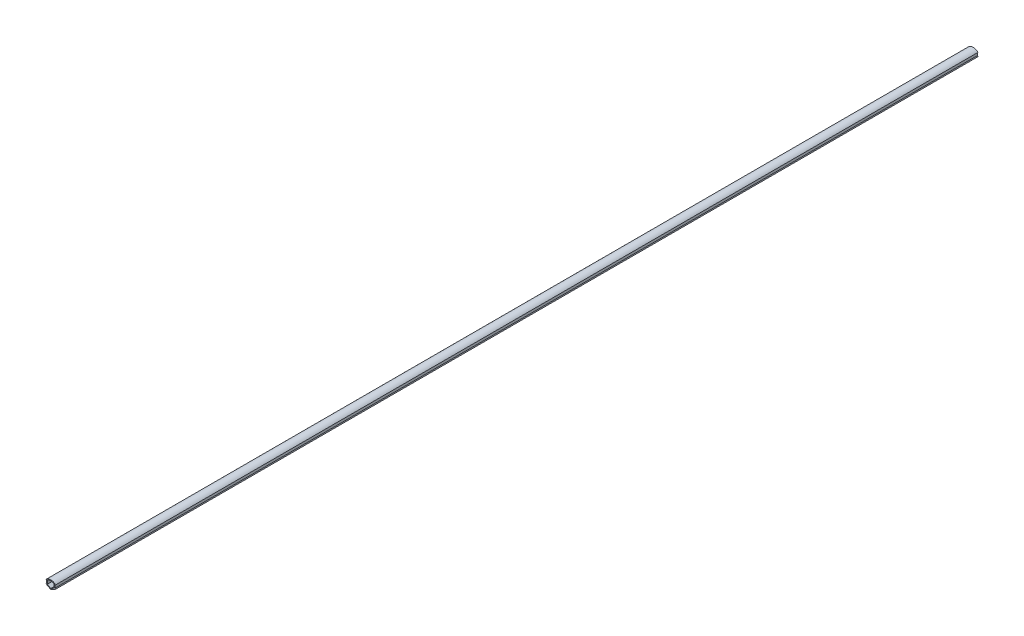
ISO-10303-21;
HEADER;
FILE_DESCRIPTION(('STEP AP214'),'2;1');
FILE_NAME('part.step','',(''),(''),'','','');
FILE_SCHEMA(('AUTOMOTIVE_DESIGN { 1 0 10303 214 1 1 1 1 }'));
ENDSEC;
DATA;
#1=APPLICATION_CONTEXT('core data for automotive mechanical design processes');
#2=APPLICATION_PROTOCOL_DEFINITION('international standard','automotive_design',2000,#1);
#3=PRODUCT_CONTEXT('',#1,'mechanical');
#4=PRODUCT('Part','Part','',(#3));
#5=PRODUCT_RELATED_PRODUCT_CATEGORY('part','',(#4));
#6=PRODUCT_DEFINITION_FORMATION('','',#4);
#7=PRODUCT_DEFINITION_CONTEXT('part definition',#1,'design');
#8=PRODUCT_DEFINITION('design','',#6,#7);
#9=PRODUCT_DEFINITION_SHAPE('','',#8);
#10=(LENGTH_UNIT() NAMED_UNIT(*) SI_UNIT(.MILLI.,.METRE.));
#11=(NAMED_UNIT(*) PLANE_ANGLE_UNIT() SI_UNIT($,.RADIAN.));
#12=(NAMED_UNIT(*) SI_UNIT($,.STERADIAN.) SOLID_ANGLE_UNIT());
#13=UNCERTAINTY_MEASURE_WITH_UNIT(LENGTH_MEASURE(1.E-05),#10,'distance_accuracy_value','');
#14=(GEOMETRIC_REPRESENTATION_CONTEXT(3) GLOBAL_UNCERTAINTY_ASSIGNED_CONTEXT((#13)) GLOBAL_UNIT_ASSIGNED_CONTEXT((#10,
#11,#12)) REPRESENTATION_CONTEXT('',''));
#15=CARTESIAN_POINT('',(0.,0.,0.));
#16=DIRECTION('',(0.,0.,1.));
#17=DIRECTION('',(1.,0.,0.));
#18=AXIS2_PLACEMENT_3D('',#15,#16,#17);
#19=CARTESIAN_POINT('',(0.,0.,1000.));
#20=DIRECTION('',(-0.499999999999998,-0.86602540378444,0.));
#21=DIRECTION('',(0.86602540378444,-0.499999999999998,0.));
#22=AXIS2_PLACEMENT_3D('',#19,#20,#21);
#23=PLANE('',#22);
#24=DIRECTION('',(-0.86602540378444,0.499999999999998,0.));
#25=VECTOR('',#24,1.);
#26=CARTESIAN_POINT('',(0.,0.,0.));
#27=LINE('',#26,#25);
#28=CARTESIAN_POINT('',(0.,0.,0.));
#29=VERTEX_POINT('',#28);
#30=CARTESIAN_POINT('',(-5.2,3.00222139978603,0.));
#31=VERTEX_POINT('',#30);
#32=EDGE_CURVE('E186',#29,#31,#27,.T.);
#33=ORIENTED_EDGE('',*,*,#32,.F.);
#34=DIRECTION('',(0.,0.,-1.));
#35=VECTOR('',#34,1.);
#36=CARTESIAN_POINT('',(0.,0.,1000.));
#37=LINE('',#36,#35);
#38=CARTESIAN_POINT('',(0.,0.,1000.));
#39=VERTEX_POINT('',#38);
#40=EDGE_CURVE('E11',#39,#29,#37,.T.);
#41=ORIENTED_EDGE('',*,*,#40,.F.);
#42=DIRECTION('',(-0.86602540378444,0.499999999999998,0.));
#43=VECTOR('',#42,1.);
#44=CARTESIAN_POINT('',(0.,0.,1000.));
#45=LINE('',#44,#43);
#46=CARTESIAN_POINT('',(-5.2,3.00222139978603,1000.));
#47=VERTEX_POINT('',#46);
#48=EDGE_CURVE('E264',#39,#47,#45,.T.);
#49=ORIENTED_EDGE('',*,*,#48,.T.);
#50=DIRECTION('',(0.,0.,-1.));
#51=VECTOR('',#50,1.);
#52=CARTESIAN_POINT('',(-5.2,3.00222139978603,1000.));
#53=LINE('',#52,#51);
#54=EDGE_CURVE('E56',#47,#31,#53,.T.);
#55=ORIENTED_EDGE('',*,*,#54,.T.);
#56=EDGE_LOOP('',(#33,#41,#49,#55));
#57=FACE_BOUND('',#56,.T.);
#58=ADVANCED_FACE('F37',(#57),#23,.T.);
#59=CARTESIAN_POINT('',(0.,0.,1000.));
#60=DIRECTION('',(-0.499999999999998,0.86602540378444,0.));
#61=DIRECTION('',(-0.86602540378444,-0.499999999999998,0.));
#62=AXIS2_PLACEMENT_3D('',#59,#60,#61);
#63=PLANE('',#62);
#64=DIRECTION('',(0.86602540378444,0.499999999999998,0.));
#65=VECTOR('',#64,1.);
#66=CARTESIAN_POINT('',(0.,0.,0.));
#67=LINE('',#66,#65);
#68=CARTESIAN_POINT('',(5.2,3.00222139978604,0.));
#69=VERTEX_POINT('',#68);
#70=EDGE_CURVE('E188',#29,#69,#67,.T.);
#71=ORIENTED_EDGE('',*,*,#70,.T.);
#72=DIRECTION('',(0.,0.,-1.));
#73=VECTOR('',#72,1.);
#74=CARTESIAN_POINT('',(5.2,3.00222139978604,1000.));
#75=LINE('',#74,#73);
#76=CARTESIAN_POINT('',(5.2,3.00222139978604,1000.));
#77=VERTEX_POINT('',#76);
#78=EDGE_CURVE('E47',#77,#69,#75,.T.);
#79=ORIENTED_EDGE('',*,*,#78,.F.);
#80=DIRECTION('',(0.86602540378444,0.499999999999998,0.));
#81=VECTOR('',#80,1.);
#82=CARTESIAN_POINT('',(0.,0.,1000.));
#83=LINE('',#82,#81);
#84=EDGE_CURVE('E266',#39,#77,#83,.T.);
#85=ORIENTED_EDGE('',*,*,#84,.F.);
#86=ORIENTED_EDGE('',*,*,#40,.T.);
#87=EDGE_LOOP('',(#71,#79,#85,#86));
#88=FACE_BOUND('',#87,.T.);
#89=ADVANCED_FACE('F293',(#88),#63,.F.);
#90=CARTESIAN_POINT('',(5.2,3.00222139978604,1000.));
#91=DIRECTION('',(-0.86602540378444,-0.499999999999998,0.));
#92=DIRECTION('',(0.499999999999998,-0.86602540378444,0.));
#93=AXIS2_PLACEMENT_3D('',#90,#91,#92);
#94=PLANE('',#93);
#95=DIRECTION('',(-0.499999999999998,0.86602540378444,0.));
#96=VECTOR('',#95,1.);
#97=CARTESIAN_POINT('',(5.2,3.00222139978604,0.));
#98=LINE('',#97,#96);
#99=CARTESIAN_POINT('',(4.7,3.86824680357048,0.));
#100=VERTEX_POINT('',#99);
#101=EDGE_CURVE('E191',#69,#100,#98,.T.);
#102=ORIENTED_EDGE('',*,*,#101,.T.);
#103=DIRECTION('',(0.,0.,-1.));
#104=VECTOR('',#103,1.);
#105=CARTESIAN_POINT('',(4.7,3.86824680357048,1000.));
#106=LINE('',#105,#104);
#107=CARTESIAN_POINT('',(4.7,3.86824680357048,1000.));
#108=VERTEX_POINT('',#107);
#109=EDGE_CURVE('E218',#108,#100,#106,.T.);
#110=ORIENTED_EDGE('',*,*,#109,.F.);
#111=DIRECTION('',(-0.499999999999998,0.86602540378444,0.));
#112=VECTOR('',#111,1.);
#113=CARTESIAN_POINT('',(5.2,3.00222139978604,1000.));
#114=LINE('',#113,#112);
#115=EDGE_CURVE('E269',#77,#108,#114,.T.);
#116=ORIENTED_EDGE('',*,*,#115,.F.);
#117=ORIENTED_EDGE('',*,*,#78,.T.);
#118=EDGE_LOOP('',(#102,#110,#116,#117));
#119=FACE_BOUND('',#118,.T.);
#120=ADVANCED_FACE('F298',(#119),#94,.F.);
#121=CARTESIAN_POINT('',(4.7,0.,1000.));
#122=DIRECTION('',(-1.,0.,0.));
#123=DIRECTION('',(0.,0.,1.));
#124=AXIS2_PLACEMENT_3D('',#121,#122,#123);
#125=PLANE('',#124);
#126=DIRECTION('',(0.,1.,0.));
#127=VECTOR('',#126,1.);
#128=CARTESIAN_POINT('',(4.7,0.,0.));
#129=LINE('',#128,#127);
#130=CARTESIAN_POINT('',(4.7,7.0749371855331,0.));
#131=VERTEX_POINT('',#130);
#132=EDGE_CURVE('E194',#100,#131,#129,.T.);
#133=ORIENTED_EDGE('',*,*,#132,.T.);
#134=DIRECTION('',(0.,0.,-1.));
#135=VECTOR('',#134,1.);
#136=CARTESIAN_POINT('',(4.7,7.0749371855331,1000.));
#137=LINE('',#136,#135);
#138=CARTESIAN_POINT('',(4.7,7.0749371855331,1000.));
#139=VERTEX_POINT('',#138);
#140=EDGE_CURVE('E215',#139,#131,#137,.T.);
#141=ORIENTED_EDGE('',*,*,#140,.F.);
#142=DIRECTION('',(0.,1.,0.));
#143=VECTOR('',#142,1.);
#144=CARTESIAN_POINT('',(4.7,0.,1000.));
#145=LINE('',#144,#143);
#146=EDGE_CURVE('E272',#108,#139,#145,.T.);
#147=ORIENTED_EDGE('',*,*,#146,.F.);
#148=ORIENTED_EDGE('',*,*,#109,.T.);
#149=EDGE_LOOP('',(#133,#141,#147,#148));
#150=FACE_BOUND('',#149,.T.);
#151=ADVANCED_FACE('F323',(#150),#125,.F.);
#152=CARTESIAN_POINT('',(0.,7.07493718553311,1000.));
#153=DIRECTION('',(0.,1.,0.));
#154=DIRECTION('',(-1.,0.,0.));
#155=AXIS2_PLACEMENT_3D('',#152,#153,#154);
#156=PLANE('',#155);
#157=DIRECTION('',(1.,0.,0.));
#158=VECTOR('',#157,1.);
#159=CARTESIAN_POINT('',(0.,7.07493718553311,0.));
#160=LINE('',#159,#158);
#161=CARTESIAN_POINT('',(5.20480547186924,7.0749371855331,0.));
#162=VERTEX_POINT('',#161);
#163=EDGE_CURVE('E197',#131,#162,#160,.T.);
#164=ORIENTED_EDGE('',*,*,#163,.T.);
#165=DIRECTION('',(0.,0.,-1.));
#166=VECTOR('',#165,1.);
#167=CARTESIAN_POINT('',(5.20480547186924,7.0749371855331,1000.));
#168=LINE('',#167,#166);
#169=CARTESIAN_POINT('',(5.20480547186924,7.0749371855331,1000.));
#170=VERTEX_POINT('',#169);
#171=EDGE_CURVE('E213',#170,#162,#168,.T.);
#172=ORIENTED_EDGE('',*,*,#171,.F.);
#173=DIRECTION('',(1.,0.,0.));
#174=VECTOR('',#173,1.);
#175=CARTESIAN_POINT('',(0.,7.07493718553311,1000.));
#176=LINE('',#175,#174);
#177=EDGE_CURVE('E275',#139,#170,#176,.T.);
#178=ORIENTED_EDGE('',*,*,#177,.F.);
#179=ORIENTED_EDGE('',*,*,#140,.T.);
#180=EDGE_LOOP('',(#164,#172,#178,#179));
#181=FACE_BOUND('',#180,.T.);
#182=ADVANCED_FACE('F320',(#181),#156,.F.);
#183=CARTESIAN_POINT('',(0.,2.1,1000.));
#184=DIRECTION('',(0.,0.,-1.));
#185=DIRECTION('',(-1.,0.,0.));
#186=AXIS2_PLACEMENT_3D('',#183,#184,#185);
#187=CYLINDRICAL_SURFACE('',#186,7.2);
#188=CARTESIAN_POINT('',(0.,2.1,0.));
#189=DIRECTION('',(0.,0.,1.));
#190=DIRECTION('',(1.,0.,0.));
#191=AXIS2_PLACEMENT_3D('',#188,#189,#190);
#192=CIRCLE('',#191,7.2);
#193=CARTESIAN_POINT('',(-5.20480547186924,7.0749371855331,0.));
#194=VERTEX_POINT('',#193);
#195=EDGE_CURVE('E200',#194,#162,#192,.F.);
#196=ORIENTED_EDGE('',*,*,#195,.F.);
#197=DIRECTION('',(0.,0.,-1.));
#198=VECTOR('',#197,1.);
#199=CARTESIAN_POINT('',(-5.20480547186924,7.0749371855331,1000.));
#200=LINE('',#199,#198);
#201=CARTESIAN_POINT('',(-5.20480547186924,7.0749371855331,1000.));
#202=VERTEX_POINT('',#201);
#203=EDGE_CURVE('E154',#202,#194,#200,.T.);
#204=ORIENTED_EDGE('',*,*,#203,.F.);
#205=CARTESIAN_POINT('',(0.,2.1,1000.));
#206=DIRECTION('',(0.,0.,1.));
#207=DIRECTION('',(1.,0.,0.));
#208=AXIS2_PLACEMENT_3D('',#205,#206,#207);
#209=CIRCLE('',#208,7.2);
#210=EDGE_CURVE('E164',#202,#170,#209,.F.);
#211=ORIENTED_EDGE('',*,*,#210,.T.);
#212=ORIENTED_EDGE('',*,*,#171,.T.);
#213=EDGE_LOOP('',(#196,#204,#211,#212));
#214=FACE_BOUND('',#213,.T.);
#215=ADVANCED_FACE('F278',(#214),#187,.T.);
#216=CARTESIAN_POINT('',(0.,7.07493718553311,1000.));
#217=DIRECTION('',(0.,-1.,0.));
#218=DIRECTION('',(1.,0.,0.));
#219=AXIS2_PLACEMENT_3D('',#216,#217,#218);
#220=PLANE('',#219);
#221=DIRECTION('',(-1.,0.,0.));
#222=VECTOR('',#221,1.);
#223=CARTESIAN_POINT('',(0.,7.07493718553311,0.));
#224=LINE('',#223,#222);
#225=CARTESIAN_POINT('',(-4.7,7.0749371855331,0.));
#226=VERTEX_POINT('',#225);
#227=EDGE_CURVE('E150',#226,#194,#224,.T.);
#228=ORIENTED_EDGE('',*,*,#227,.F.);
#229=DIRECTION('',(0.,0.,-1.));
#230=VECTOR('',#229,1.);
#231=CARTESIAN_POINT('',(-4.7,7.0749371855331,1000.));
#232=LINE('',#231,#230);
#233=CARTESIAN_POINT('',(-4.7,7.0749371855331,1000.));
#234=VERTEX_POINT('',#233);
#235=EDGE_CURVE('E145',#234,#226,#232,.T.);
#236=ORIENTED_EDGE('',*,*,#235,.F.);
#237=DIRECTION('',(-1.,0.,0.));
#238=VECTOR('',#237,1.);
#239=CARTESIAN_POINT('',(0.,7.07493718553311,1000.));
#240=LINE('',#239,#238);
#241=EDGE_CURVE('E148',#234,#202,#240,.T.);
#242=ORIENTED_EDGE('',*,*,#241,.T.);
#243=ORIENTED_EDGE('',*,*,#203,.T.);
#244=EDGE_LOOP('',(#228,#236,#242,#243));
#245=FACE_BOUND('',#244,.T.);
#246=ADVANCED_FACE('F147',(#245),#220,.T.);
#247=CARTESIAN_POINT('',(-4.7,0.,1000.));
#248=DIRECTION('',(-1.,0.,0.));
#249=DIRECTION('',(0.,0.,1.));
#250=AXIS2_PLACEMENT_3D('',#247,#248,#249);
#251=PLANE('',#250);
#252=DIRECTION('',(0.,1.,0.));
#253=VECTOR('',#252,1.);
#254=CARTESIAN_POINT('',(-4.7,0.,0.));
#255=LINE('',#254,#253);
#256=CARTESIAN_POINT('',(-4.7,3.86824680357048,0.));
#257=VERTEX_POINT('',#256);
#258=EDGE_CURVE('E204',#257,#226,#255,.T.);
#259=ORIENTED_EDGE('',*,*,#258,.F.);
#260=DIRECTION('',(0.,0.,-1.));
#261=VECTOR('',#260,1.);
#262=CARTESIAN_POINT('',(-4.7,3.86824680357048,1000.));
#263=LINE('',#262,#261);
#264=CARTESIAN_POINT('',(-4.7,3.86824680357048,1000.));
#265=VERTEX_POINT('',#264);
#266=EDGE_CURVE('E99',#265,#257,#263,.T.);
#267=ORIENTED_EDGE('',*,*,#266,.F.);
#268=DIRECTION('',(0.,1.,0.));
#269=VECTOR('',#268,1.);
#270=CARTESIAN_POINT('',(-4.7,0.,1000.));
#271=LINE('',#270,#269);
#272=EDGE_CURVE('E162',#265,#234,#271,.T.);
#273=ORIENTED_EDGE('',*,*,#272,.T.);
#274=ORIENTED_EDGE('',*,*,#235,.T.);
#275=EDGE_LOOP('',(#259,#267,#273,#274));
#276=FACE_BOUND('',#275,.T.);
#277=ADVANCED_FACE('F166',(#276),#251,.T.);
#278=CARTESIAN_POINT('',(-0.499999999999998,0.86602540378444,1000.));
#279=DIRECTION('',(-0.499999999999998,0.86602540378444,0.));
#280=DIRECTION('',(-0.86602540378444,-0.499999999999998,0.));
#281=AXIS2_PLACEMENT_3D('',#278,#279,#280);
#282=PLANE('',#281);
#283=DIRECTION('',(0.86602540378444,0.499999999999998,0.));
#284=VECTOR('',#283,1.);
#285=CARTESIAN_POINT('',(-0.499999999999998,0.86602540378444,0.));
#286=LINE('',#285,#284);
#287=CARTESIAN_POINT('',(0.,1.15470053837925,0.));
#288=VERTEX_POINT('',#287);
#289=CARTESIAN_POINT('',(3.7,3.29089653438085,0.));
#290=VERTEX_POINT('',#289);
#291=EDGE_CURVE('E173',#288,#290,#286,.T.);
#292=ORIENTED_EDGE('',*,*,#291,.F.);
#293=DIRECTION('',(0.,0.,-1.));
#294=VECTOR('',#293,1.);
#295=CARTESIAN_POINT('',(0.,1.15470053837925,1000.));
#296=LINE('',#295,#294);
#297=CARTESIAN_POINT('',(0.,1.15470053837925,1000.));
#298=VERTEX_POINT('',#297);
#299=EDGE_CURVE('E41',#298,#288,#296,.T.);
#300=ORIENTED_EDGE('',*,*,#299,.F.);
#301=DIRECTION('',(0.86602540378444,0.499999999999998,0.));
#302=VECTOR('',#301,1.);
#303=CARTESIAN_POINT('',(-0.499999999999998,0.86602540378444,1000.));
#304=LINE('',#303,#302);
#305=CARTESIAN_POINT('',(3.7,3.29089653438085,1000.));
#306=VERTEX_POINT('',#305);
#307=EDGE_CURVE('E209',#298,#306,#304,.T.);
#308=ORIENTED_EDGE('',*,*,#307,.T.);
#309=DIRECTION('',(0.,0.,-1.));
#310=VECTOR('',#309,1.);
#311=CARTESIAN_POINT('',(3.7,3.29089653438085,1000.));
#312=LINE('',#311,#310);
#313=EDGE_CURVE('E169',#306,#290,#312,.T.);
#314=ORIENTED_EDGE('',*,*,#313,.T.);
#315=EDGE_LOOP('',(#292,#300,#308,#314));
#316=FACE_BOUND('',#315,.T.);
#317=ADVANCED_FACE('F39',(#316),#282,.T.);
#318=CARTESIAN_POINT('',(0.499999999999998,0.86602540378444,1000.));
#319=DIRECTION('',(-0.499999999999998,-0.86602540378444,0.));
#320=DIRECTION('',(0.86602540378444,-0.499999999999998,0.));
#321=AXIS2_PLACEMENT_3D('',#318,#319,#320);
#322=PLANE('',#321);
#323=DIRECTION('',(-0.86602540378444,0.499999999999998,0.));
#324=VECTOR('',#323,1.);
#325=CARTESIAN_POINT('',(0.499999999999998,0.86602540378444,0.));
#326=LINE('',#325,#324);
#327=CARTESIAN_POINT('',(-3.7,3.29089653438085,0.));
#328=VERTEX_POINT('',#327);
#329=EDGE_CURVE('E176',#288,#328,#326,.T.);
#330=ORIENTED_EDGE('',*,*,#329,.T.);
#331=DIRECTION('',(0.,0.,-1.));
#332=VECTOR('',#331,1.);
#333=CARTESIAN_POINT('',(-3.7,3.29089653438085,1000.));
#334=LINE('',#333,#332);
#335=CARTESIAN_POINT('',(-3.7,3.29089653438085,1000.));
#336=VERTEX_POINT('',#335);
#337=EDGE_CURVE('E228',#336,#328,#334,.T.);
#338=ORIENTED_EDGE('',*,*,#337,.F.);
#339=DIRECTION('',(-0.86602540378444,0.499999999999998,0.));
#340=VECTOR('',#339,1.);
#341=CARTESIAN_POINT('',(0.499999999999998,0.86602540378444,1000.));
#342=LINE('',#341,#340);
#343=EDGE_CURVE('E237',#298,#336,#342,.T.);
#344=ORIENTED_EDGE('',*,*,#343,.F.);
#345=ORIENTED_EDGE('',*,*,#299,.T.);
#346=EDGE_LOOP('',(#330,#338,#344,#345));
#347=FACE_BOUND('',#346,.T.);
#348=ADVANCED_FACE('F236',(#347),#322,.F.);
#349=CARTESIAN_POINT('',(-3.7,0.,1000.));
#350=DIRECTION('',(-1.,0.,0.));
#351=DIRECTION('',(0.,0.,1.));
#352=AXIS2_PLACEMENT_3D('',#349,#350,#351);
#353=PLANE('',#352);
#354=DIRECTION('',(0.,1.,0.));
#355=VECTOR('',#354,1.);
#356=CARTESIAN_POINT('',(-3.7,0.,0.));
#357=LINE('',#356,#355);
#358=CARTESIAN_POINT('',(-3.7,7.0749371855331,0.));
#359=VERTEX_POINT('',#358);
#360=EDGE_CURVE('E178',#328,#359,#357,.T.);
#361=ORIENTED_EDGE('',*,*,#360,.T.);
#362=DIRECTION('',(0.,0.,-1.));
#363=VECTOR('',#362,1.);
#364=CARTESIAN_POINT('',(-3.7,7.0749371855331,1000.));
#365=LINE('',#364,#363);
#366=CARTESIAN_POINT('',(-3.7,7.0749371855331,1000.));
#367=VERTEX_POINT('',#366);
#368=EDGE_CURVE('E226',#367,#359,#365,.T.);
#369=ORIENTED_EDGE('',*,*,#368,.F.);
#370=DIRECTION('',(0.,1.,0.));
#371=VECTOR('',#370,1.);
#372=CARTESIAN_POINT('',(-3.7,0.,1000.));
#373=LINE('',#372,#371);
#374=EDGE_CURVE('E256',#336,#367,#373,.T.);
#375=ORIENTED_EDGE('',*,*,#374,.F.);
#376=ORIENTED_EDGE('',*,*,#337,.T.);
#377=EDGE_LOOP('',(#361,#369,#375,#376));
#378=FACE_BOUND('',#377,.T.);
#379=ADVANCED_FACE('F255',(#378),#353,.F.);
#380=CARTESIAN_POINT('',(0.,2.1,1000.));
#381=DIRECTION('',(0.,0.,-1.));
#382=DIRECTION('',(-1.,0.,0.));
#383=AXIS2_PLACEMENT_3D('',#380,#381,#382);
#384=CYLINDRICAL_SURFACE('',#383,6.2);
#385=CARTESIAN_POINT('',(0.,2.1,0.));
#386=DIRECTION('',(0.,0.,1.));
#387=DIRECTION('',(1.,0.,0.));
#388=AXIS2_PLACEMENT_3D('',#385,#386,#387);
#389=CIRCLE('',#388,6.2);
#390=CARTESIAN_POINT('',(3.7,7.0749371855331,0.));
#391=VERTEX_POINT('',#390);
#392=EDGE_CURVE('E180',#359,#391,#389,.F.);
#393=ORIENTED_EDGE('',*,*,#392,.T.);
#394=DIRECTION('',(0.,0.,-1.));
#395=VECTOR('',#394,1.);
#396=CARTESIAN_POINT('',(3.7,7.0749371855331,1000.));
#397=LINE('',#396,#395);
#398=CARTESIAN_POINT('',(3.7,7.0749371855331,1000.));
#399=VERTEX_POINT('',#398);
#400=EDGE_CURVE('E224',#399,#391,#397,.T.);
#401=ORIENTED_EDGE('',*,*,#400,.F.);
#402=CARTESIAN_POINT('',(0.,2.1,1000.));
#403=DIRECTION('',(0.,0.,1.));
#404=DIRECTION('',(1.,0.,0.));
#405=AXIS2_PLACEMENT_3D('',#402,#403,#404);
#406=CIRCLE('',#405,6.2);
#407=EDGE_CURVE('E254',#367,#399,#406,.F.);
#408=ORIENTED_EDGE('',*,*,#407,.F.);
#409=ORIENTED_EDGE('',*,*,#368,.T.);
#410=EDGE_LOOP('',(#393,#401,#408,#409));
#411=FACE_BOUND('',#410,.T.);
#412=ADVANCED_FACE('F251',(#411),#384,.F.);
#413=CARTESIAN_POINT('',(3.7,0.,1000.));
#414=DIRECTION('',(-1.,0.,0.));
#415=DIRECTION('',(0.,0.,1.));
#416=AXIS2_PLACEMENT_3D('',#413,#414,#415);
#417=PLANE('',#416);
#418=DIRECTION('',(0.,1.,0.));
#419=VECTOR('',#418,1.);
#420=CARTESIAN_POINT('',(3.7,0.,0.));
#421=LINE('',#420,#419);
#422=EDGE_CURVE('E183',#290,#391,#421,.T.);
#423=ORIENTED_EDGE('',*,*,#422,.F.);
#424=ORIENTED_EDGE('',*,*,#313,.F.);
#425=DIRECTION('',(0.,1.,0.));
#426=VECTOR('',#425,1.);
#427=CARTESIAN_POINT('',(3.7,0.,1000.));
#428=LINE('',#427,#426);
#429=EDGE_CURVE('E248',#306,#399,#428,.T.);
#430=ORIENTED_EDGE('',*,*,#429,.T.);
#431=ORIENTED_EDGE('',*,*,#400,.T.);
#432=EDGE_LOOP('',(#423,#424,#430,#431));
#433=FACE_BOUND('',#432,.T.);
#434=ADVANCED_FACE('F247',(#433),#417,.T.);
#435=CARTESIAN_POINT('',(-5.2,3.00222139978603,1000.));
#436=DIRECTION('',(-0.86602540378444,0.499999999999997,0.));
#437=DIRECTION('',(-0.499999999999997,-0.86602540378444,0.));
#438=AXIS2_PLACEMENT_3D('',#435,#436,#437);
#439=PLANE('',#438);
#440=DIRECTION('',(0.499999999999997,0.86602540378444,0.));
#441=VECTOR('',#440,1.);
#442=CARTESIAN_POINT('',(-5.2,3.00222139978603,0.));
#443=LINE('',#442,#441);
#444=EDGE_CURVE('E206',#31,#257,#443,.T.);
#445=ORIENTED_EDGE('',*,*,#444,.F.);
#446=ORIENTED_EDGE('',*,*,#54,.F.);
#447=DIRECTION('',(0.499999999999997,0.86602540378444,0.));
#448=VECTOR('',#447,1.);
#449=CARTESIAN_POINT('',(-5.2,3.00222139978603,1000.));
#450=LINE('',#449,#448);
#451=EDGE_CURVE('E167',#47,#265,#450,.T.);
#452=ORIENTED_EDGE('',*,*,#451,.T.);
#453=ORIENTED_EDGE('',*,*,#266,.T.);
#454=EDGE_LOOP('',(#445,#446,#452,#453));
#455=FACE_BOUND('',#454,.T.);
#456=ADVANCED_FACE('F281',(#455),#439,.T.);
#457=CARTESIAN_POINT('',(0.,0.,1000.));
#458=DIRECTION('',(0.,0.,1.));
#459=DIRECTION('',(1.,0.,0.));
#460=AXIS2_PLACEMENT_3D('',#457,#458,#459);
#461=PLANE('',#460);
#462=ORIENTED_EDGE('',*,*,#307,.F.);
#463=ORIENTED_EDGE('',*,*,#343,.T.);
#464=ORIENTED_EDGE('',*,*,#374,.T.);
#465=ORIENTED_EDGE('',*,*,#407,.T.);
#466=ORIENTED_EDGE('',*,*,#429,.F.);
#467=EDGE_LOOP('',(#462,#463,#464,#465,#466));
#468=FACE_BOUND('',#467,.T.);
#469=ORIENTED_EDGE('',*,*,#48,.F.);
#470=ORIENTED_EDGE('',*,*,#84,.T.);
#471=ORIENTED_EDGE('',*,*,#115,.T.);
#472=ORIENTED_EDGE('',*,*,#146,.T.);
#473=ORIENTED_EDGE('',*,*,#177,.T.);
#474=ORIENTED_EDGE('',*,*,#210,.F.);
#475=ORIENTED_EDGE('',*,*,#241,.F.);
#476=ORIENTED_EDGE('',*,*,#272,.F.);
#477=ORIENTED_EDGE('',*,*,#451,.F.);
#478=EDGE_LOOP('',(#469,#470,#471,#472,#473,#474,#475,#476,#477));
#479=FACE_BOUND('',#478,.T.);
#480=ADVANCED_FACE('F160',(#468,#479),#461,.T.);
#481=CARTESIAN_POINT('',(0.,0.,0.));
#482=DIRECTION('',(0.,0.,1.));
#483=DIRECTION('',(1.,0.,0.));
#484=AXIS2_PLACEMENT_3D('',#481,#482,#483);
#485=PLANE('',#484);
#486=ORIENTED_EDGE('',*,*,#291,.T.);
#487=ORIENTED_EDGE('',*,*,#422,.T.);
#488=ORIENTED_EDGE('',*,*,#392,.F.);
#489=ORIENTED_EDGE('',*,*,#360,.F.);
#490=ORIENTED_EDGE('',*,*,#329,.F.);
#491=EDGE_LOOP('',(#486,#487,#488,#489,#490));
#492=FACE_BOUND('',#491,.T.);
#493=ORIENTED_EDGE('',*,*,#32,.T.);
#494=ORIENTED_EDGE('',*,*,#444,.T.);
#495=ORIENTED_EDGE('',*,*,#258,.T.);
#496=ORIENTED_EDGE('',*,*,#227,.T.);
#497=ORIENTED_EDGE('',*,*,#195,.T.);
#498=ORIENTED_EDGE('',*,*,#163,.F.);
#499=ORIENTED_EDGE('',*,*,#132,.F.);
#500=ORIENTED_EDGE('',*,*,#101,.F.);
#501=ORIENTED_EDGE('',*,*,#70,.F.);
#502=EDGE_LOOP('',(#493,#494,#495,#496,#497,#498,#499,#500,#501));
#503=FACE_BOUND('',#502,.T.);
#504=ADVANCED_FACE('F240',(#492,#503),#485,.F.);
#505=CLOSED_SHELL('',(#58,#89,#120,#151,#182,#215,#246,#277,#317,#348,#379,#412,#434,#456,#480,#504));
#506=MANIFOLD_SOLID_BREP('B2',#505);
#507=ADVANCED_BREP_SHAPE_REPRESENTATION('',(#18,#506),#14);
#508=SHAPE_DEFINITION_REPRESENTATION(#9,#507);
ENDSEC;
END-ISO-10303-21;
